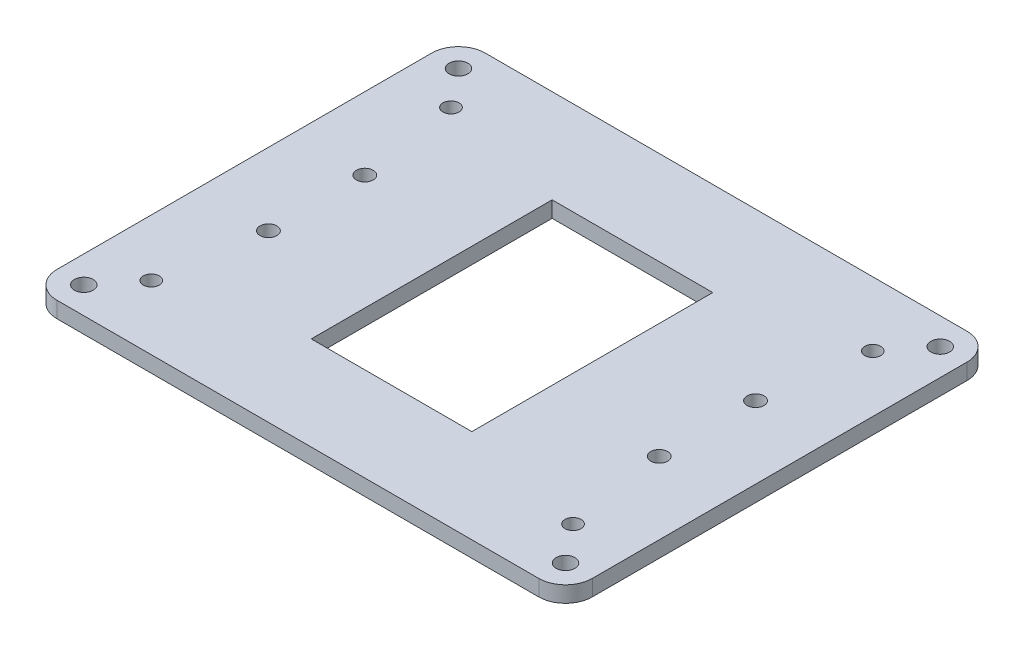
ISO-10303-21;
HEADER;
FILE_DESCRIPTION(('STEP AP214'),'2;1');
FILE_NAME('part.step','',(''),(''),'','','');
FILE_SCHEMA(('AUTOMOTIVE_DESIGN { 1 0 10303 214 1 1 1 1 }'));
ENDSEC;
DATA;
#1=APPLICATION_CONTEXT('core data for automotive mechanical design processes');
#2=APPLICATION_PROTOCOL_DEFINITION('international standard','automotive_design',2000,#1);
#3=PRODUCT_CONTEXT('',#1,'mechanical');
#4=PRODUCT('Part','Part','',(#3));
#5=PRODUCT_RELATED_PRODUCT_CATEGORY('part','',(#4));
#6=PRODUCT_DEFINITION_FORMATION('','',#4);
#7=PRODUCT_DEFINITION_CONTEXT('part definition',#1,'design');
#8=PRODUCT_DEFINITION('design','',#6,#7);
#9=PRODUCT_DEFINITION_SHAPE('','',#8);
#10=(LENGTH_UNIT() NAMED_UNIT(*) SI_UNIT(.MILLI.,.METRE.));
#11=(NAMED_UNIT(*) PLANE_ANGLE_UNIT() SI_UNIT($,.RADIAN.));
#12=(NAMED_UNIT(*) SI_UNIT($,.STERADIAN.) SOLID_ANGLE_UNIT());
#13=UNCERTAINTY_MEASURE_WITH_UNIT(LENGTH_MEASURE(1.E-05),#10,'distance_accuracy_value','');
#14=(GEOMETRIC_REPRESENTATION_CONTEXT(3) GLOBAL_UNCERTAINTY_ASSIGNED_CONTEXT((#13)) GLOBAL_UNIT_ASSIGNED_CONTEXT((#10,
#11,#12)) REPRESENTATION_CONTEXT('',''));
#15=CARTESIAN_POINT('',(0.,0.,0.));
#16=DIRECTION('',(0.,0.,1.));
#17=DIRECTION('',(1.,0.,0.));
#18=AXIS2_PLACEMENT_3D('',#15,#16,#17);
#19=CARTESIAN_POINT('',(45.,3.,-35.));
#20=DIRECTION('',(0.,-1.,0.));
#21=DIRECTION('',(0.,0.,-1.));
#22=AXIS2_PLACEMENT_3D('',#19,#20,#21);
#23=CYLINDRICAL_SURFACE('',#22,5.);
#24=CARTESIAN_POINT('',(45.,0.,-35.));
#25=DIRECTION('',(0.,1.,0.));
#26=DIRECTION('',(0.,0.,-1.));
#27=AXIS2_PLACEMENT_3D('',#24,#25,#26);
#28=CIRCLE('',#27,5.);
#29=CARTESIAN_POINT('',(50.,0.,-35.));
#30=VERTEX_POINT('',#29);
#31=CARTESIAN_POINT('',(45.,0.,-40.));
#32=VERTEX_POINT('',#31);
#33=EDGE_CURVE('E239',#30,#32,#28,.T.);
#34=ORIENTED_EDGE('',*,*,#33,.T.);
#35=DIRECTION('',(0.,-1.,0.));
#36=VECTOR('',#35,1.);
#37=CARTESIAN_POINT('',(45.,3.,-40.));
#38=LINE('',#37,#36);
#39=CARTESIAN_POINT('',(45.,3.,-40.));
#40=VERTEX_POINT('',#39);
#41=EDGE_CURVE('E11',#40,#32,#38,.T.);
#42=ORIENTED_EDGE('',*,*,#41,.F.);
#43=CARTESIAN_POINT('',(45.,3.,-35.));
#44=DIRECTION('',(0.,1.,0.));
#45=DIRECTION('',(0.,0.,-1.));
#46=AXIS2_PLACEMENT_3D('',#43,#44,#45);
#47=CIRCLE('',#46,5.);
#48=CARTESIAN_POINT('',(50.,3.,-35.));
#49=VERTEX_POINT('',#48);
#50=EDGE_CURVE('E220',#49,#40,#47,.T.);
#51=ORIENTED_EDGE('',*,*,#50,.F.);
#52=DIRECTION('',(0.,-1.,0.));
#53=VECTOR('',#52,1.);
#54=CARTESIAN_POINT('',(50.,3.,-35.));
#55=LINE('',#54,#53);
#56=EDGE_CURVE('E238',#49,#30,#55,.T.);
#57=ORIENTED_EDGE('',*,*,#56,.T.);
#58=EDGE_LOOP('',(#34,#42,#51,#57));
#59=FACE_BOUND('',#58,.T.);
#60=ADVANCED_FACE('F33',(#59),#23,.T.);
#61=CARTESIAN_POINT('',(-45.,3.,-40.));
#62=DIRECTION('',(0.,0.,1.));
#63=DIRECTION('',(1.,0.,0.));
#64=AXIS2_PLACEMENT_3D('',#61,#62,#63);
#65=PLANE('',#64);
#66=DIRECTION('',(-1.,0.,0.));
#67=VECTOR('',#66,1.);
#68=CARTESIAN_POINT('',(-45.,0.,-40.));
#69=LINE('',#68,#67);
#70=CARTESIAN_POINT('',(-45.,0.,-40.));
#71=VERTEX_POINT('',#70);
#72=EDGE_CURVE('E242',#32,#71,#69,.T.);
#73=ORIENTED_EDGE('',*,*,#72,.T.);
#74=DIRECTION('',(0.,-1.,0.));
#75=VECTOR('',#74,1.);
#76=CARTESIAN_POINT('',(-45.,3.,-40.));
#77=LINE('',#76,#75);
#78=CARTESIAN_POINT('',(-45.,3.,-40.));
#79=VERTEX_POINT('',#78);
#80=EDGE_CURVE('E41',#79,#71,#77,.T.);
#81=ORIENTED_EDGE('',*,*,#80,.F.);
#82=DIRECTION('',(-1.,0.,0.));
#83=VECTOR('',#82,1.);
#84=CARTESIAN_POINT('',(-45.,3.,-40.));
#85=LINE('',#84,#83);
#86=EDGE_CURVE('E223',#40,#79,#85,.T.);
#87=ORIENTED_EDGE('',*,*,#86,.F.);
#88=ORIENTED_EDGE('',*,*,#41,.T.);
#89=EDGE_LOOP('',(#73,#81,#87,#88));
#90=FACE_BOUND('',#89,.T.);
#91=ADVANCED_FACE('F334',(#90),#65,.F.);
#92=CARTESIAN_POINT('',(-45.,3.,-35.));
#93=DIRECTION('',(0.,-1.,0.));
#94=DIRECTION('',(0.,0.,-1.));
#95=AXIS2_PLACEMENT_3D('',#92,#93,#94);
#96=CYLINDRICAL_SURFACE('',#95,4.99999999999999);
#97=CARTESIAN_POINT('',(-45.,0.,-35.));
#98=DIRECTION('',(0.,1.,0.));
#99=DIRECTION('',(0.,0.,1.));
#100=AXIS2_PLACEMENT_3D('',#97,#98,#99);
#101=CIRCLE('',#100,4.99999999999999);
#102=CARTESIAN_POINT('',(-50.,0.,-35.));
#103=VERTEX_POINT('',#102);
#104=EDGE_CURVE('E244',#71,#103,#101,.T.);
#105=ORIENTED_EDGE('',*,*,#104,.T.);
#106=DIRECTION('',(0.,-1.,0.));
#107=VECTOR('',#106,1.);
#108=CARTESIAN_POINT('',(-50.,3.,-35.));
#109=LINE('',#108,#107);
#110=CARTESIAN_POINT('',(-50.,3.,-35.));
#111=VERTEX_POINT('',#110);
#112=EDGE_CURVE('E269',#111,#103,#109,.T.);
#113=ORIENTED_EDGE('',*,*,#112,.F.);
#114=CARTESIAN_POINT('',(-45.,3.,-35.));
#115=DIRECTION('',(0.,1.,0.));
#116=DIRECTION('',(0.,0.,1.));
#117=AXIS2_PLACEMENT_3D('',#114,#115,#116);
#118=CIRCLE('',#117,4.99999999999999);
#119=EDGE_CURVE('E226',#79,#111,#118,.T.);
#120=ORIENTED_EDGE('',*,*,#119,.F.);
#121=ORIENTED_EDGE('',*,*,#80,.T.);
#122=EDGE_LOOP('',(#105,#113,#120,#121));
#123=FACE_BOUND('',#122,.T.);
#124=ADVANCED_FACE('F330',(#123),#96,.T.);
#125=CARTESIAN_POINT('',(-50.,3.,-35.));
#126=DIRECTION('',(1.,0.,0.));
#127=DIRECTION('',(0.,0.,-1.));
#128=AXIS2_PLACEMENT_3D('',#125,#126,#127);
#129=PLANE('',#128);
#130=DIRECTION('',(0.,0.,1.));
#131=VECTOR('',#130,1.);
#132=CARTESIAN_POINT('',(-50.,0.,-35.));
#133=LINE('',#132,#131);
#134=CARTESIAN_POINT('',(-50.,0.,35.));
#135=VERTEX_POINT('',#134);
#136=EDGE_CURVE('E246',#103,#135,#133,.T.);
#137=ORIENTED_EDGE('',*,*,#136,.T.);
#138=DIRECTION('',(0.,-1.,0.));
#139=VECTOR('',#138,1.);
#140=CARTESIAN_POINT('',(-50.,3.,35.));
#141=LINE('',#140,#139);
#142=CARTESIAN_POINT('',(-50.,3.,35.));
#143=VERTEX_POINT('',#142);
#144=EDGE_CURVE('E266',#143,#135,#141,.T.);
#145=ORIENTED_EDGE('',*,*,#144,.F.);
#146=DIRECTION('',(0.,0.,1.));
#147=VECTOR('',#146,1.);
#148=CARTESIAN_POINT('',(-50.,3.,-35.));
#149=LINE('',#148,#147);
#150=EDGE_CURVE('E228',#111,#143,#149,.T.);
#151=ORIENTED_EDGE('',*,*,#150,.F.);
#152=ORIENTED_EDGE('',*,*,#112,.T.);
#153=EDGE_LOOP('',(#137,#145,#151,#152));
#154=FACE_BOUND('',#153,.T.);
#155=ADVANCED_FACE('F327',(#154),#129,.F.);
#156=CARTESIAN_POINT('',(-45.,3.,35.));
#157=DIRECTION('',(0.,-1.,0.));
#158=DIRECTION('',(0.,0.,-1.));
#159=AXIS2_PLACEMENT_3D('',#156,#157,#158);
#160=CYLINDRICAL_SURFACE('',#159,4.99999999999999);
#161=CARTESIAN_POINT('',(-45.,0.,35.));
#162=DIRECTION('',(0.,1.,0.));
#163=DIRECTION('',(0.,0.,1.));
#164=AXIS2_PLACEMENT_3D('',#161,#162,#163);
#165=CIRCLE('',#164,4.99999999999999);
#166=CARTESIAN_POINT('',(-45.,0.,40.));
#167=VERTEX_POINT('',#166);
#168=EDGE_CURVE('E248',#135,#167,#165,.T.);
#169=ORIENTED_EDGE('',*,*,#168,.T.);
#170=DIRECTION('',(0.,-1.,0.));
#171=VECTOR('',#170,1.);
#172=CARTESIAN_POINT('',(-45.,3.,40.));
#173=LINE('',#172,#171);
#174=CARTESIAN_POINT('',(-45.,3.,40.));
#175=VERTEX_POINT('',#174);
#176=EDGE_CURVE('E263',#175,#167,#173,.T.);
#177=ORIENTED_EDGE('',*,*,#176,.F.);
#178=CARTESIAN_POINT('',(-45.,3.,35.));
#179=DIRECTION('',(0.,1.,0.));
#180=DIRECTION('',(0.,0.,1.));
#181=AXIS2_PLACEMENT_3D('',#178,#179,#180);
#182=CIRCLE('',#181,4.99999999999999);
#183=EDGE_CURVE('E230',#143,#175,#182,.T.);
#184=ORIENTED_EDGE('',*,*,#183,.F.);
#185=ORIENTED_EDGE('',*,*,#144,.T.);
#186=EDGE_LOOP('',(#169,#177,#184,#185));
#187=FACE_BOUND('',#186,.T.);
#188=ADVANCED_FACE('F323',(#187),#160,.T.);
#189=CARTESIAN_POINT('',(-45.,3.,40.));
#190=DIRECTION('',(0.,0.,-1.));
#191=DIRECTION('',(-1.,0.,0.));
#192=AXIS2_PLACEMENT_3D('',#189,#190,#191);
#193=PLANE('',#192);
#194=DIRECTION('',(1.,0.,0.));
#195=VECTOR('',#194,1.);
#196=CARTESIAN_POINT('',(-45.,0.,40.));
#197=LINE('',#196,#195);
#198=CARTESIAN_POINT('',(45.,0.,40.));
#199=VERTEX_POINT('',#198);
#200=EDGE_CURVE('E250',#167,#199,#197,.T.);
#201=ORIENTED_EDGE('',*,*,#200,.T.);
#202=DIRECTION('',(0.,-1.,0.));
#203=VECTOR('',#202,1.);
#204=CARTESIAN_POINT('',(45.,3.,40.));
#205=LINE('',#204,#203);
#206=CARTESIAN_POINT('',(45.,3.,40.));
#207=VERTEX_POINT('',#206);
#208=EDGE_CURVE('E260',#207,#199,#205,.T.);
#209=ORIENTED_EDGE('',*,*,#208,.F.);
#210=DIRECTION('',(1.,0.,0.));
#211=VECTOR('',#210,1.);
#212=CARTESIAN_POINT('',(-45.,3.,40.));
#213=LINE('',#212,#211);
#214=EDGE_CURVE('E232',#175,#207,#213,.T.);
#215=ORIENTED_EDGE('',*,*,#214,.F.);
#216=ORIENTED_EDGE('',*,*,#176,.T.);
#217=EDGE_LOOP('',(#201,#209,#215,#216));
#218=FACE_BOUND('',#217,.T.);
#219=ADVANCED_FACE('F318',(#218),#193,.F.);
#220=CARTESIAN_POINT('',(45.,3.,35.));
#221=DIRECTION('',(0.,-1.,0.));
#222=DIRECTION('',(0.,0.,-1.));
#223=AXIS2_PLACEMENT_3D('',#220,#221,#222);
#224=CYLINDRICAL_SURFACE('',#223,4.99999999999999);
#225=CARTESIAN_POINT('',(45.,0.,35.));
#226=DIRECTION('',(0.,1.,0.));
#227=DIRECTION('',(0.,0.,1.));
#228=AXIS2_PLACEMENT_3D('',#225,#226,#227);
#229=CIRCLE('',#228,4.99999999999999);
#230=CARTESIAN_POINT('',(50.,0.,35.));
#231=VERTEX_POINT('',#230);
#232=EDGE_CURVE('E252',#199,#231,#229,.T.);
#233=ORIENTED_EDGE('',*,*,#232,.T.);
#234=DIRECTION('',(0.,-1.,0.));
#235=VECTOR('',#234,1.);
#236=CARTESIAN_POINT('',(50.,3.,35.));
#237=LINE('',#236,#235);
#238=CARTESIAN_POINT('',(50.,3.,35.));
#239=VERTEX_POINT('',#238);
#240=EDGE_CURVE('E257',#239,#231,#237,.T.);
#241=ORIENTED_EDGE('',*,*,#240,.F.);
#242=CARTESIAN_POINT('',(45.,3.,35.));
#243=DIRECTION('',(0.,1.,0.));
#244=DIRECTION('',(0.,0.,1.));
#245=AXIS2_PLACEMENT_3D('',#242,#243,#244);
#246=CIRCLE('',#245,4.99999999999999);
#247=EDGE_CURVE('E234',#207,#239,#246,.T.);
#248=ORIENTED_EDGE('',*,*,#247,.F.);
#249=ORIENTED_EDGE('',*,*,#208,.T.);
#250=EDGE_LOOP('',(#233,#241,#248,#249));
#251=FACE_BOUND('',#250,.T.);
#252=ADVANCED_FACE('F312',(#251),#224,.T.);
#253=CARTESIAN_POINT('',(50.,3.,-35.));
#254=DIRECTION('',(-1.,0.,0.));
#255=DIRECTION('',(0.,0.,1.));
#256=AXIS2_PLACEMENT_3D('',#253,#254,#255);
#257=PLANE('',#256);
#258=DIRECTION('',(0.,0.,-1.));
#259=VECTOR('',#258,1.);
#260=CARTESIAN_POINT('',(50.,0.,-35.));
#261=LINE('',#260,#259);
#262=EDGE_CURVE('E224',#231,#30,#261,.T.);
#263=ORIENTED_EDGE('',*,*,#262,.T.);
#264=ORIENTED_EDGE('',*,*,#56,.F.);
#265=DIRECTION('',(0.,0.,-1.));
#266=VECTOR('',#265,1.);
#267=CARTESIAN_POINT('',(50.,3.,-35.));
#268=LINE('',#267,#266);
#269=EDGE_CURVE('E236',#239,#49,#268,.T.);
#270=ORIENTED_EDGE('',*,*,#269,.F.);
#271=ORIENTED_EDGE('',*,*,#240,.T.);
#272=EDGE_LOOP('',(#263,#264,#270,#271));
#273=FACE_BOUND('',#272,.T.);
#274=ADVANCED_FACE('F308',(#273),#257,.F.);
#275=CARTESIAN_POINT('',(45.,3.,-35.));
#276=DIRECTION('',(0.,-1.,0.));
#277=DIRECTION('',(0.,0.,-1.));
#278=AXIS2_PLACEMENT_3D('',#275,#276,#277);
#279=PLANE('',#278);
#280=DIRECTION('',(-1.,0.,0.));
#281=VECTOR('',#280,1.);
#282=CARTESIAN_POINT('',(-15.,3.,-22.5));
#283=LINE('',#282,#281);
#284=CARTESIAN_POINT('',(15.,3.,-22.5));
#285=VERTEX_POINT('',#284);
#286=CARTESIAN_POINT('',(-15.,3.,-22.5));
#287=VERTEX_POINT('',#286);
#288=EDGE_CURVE('E150',#285,#287,#283,.T.);
#289=ORIENTED_EDGE('',*,*,#288,.F.);
#290=DIRECTION('',(0.,0.,-1.));
#291=VECTOR('',#290,1.);
#292=CARTESIAN_POINT('',(15.,3.,-22.5));
#293=LINE('',#292,#291);
#294=CARTESIAN_POINT('',(15.,3.,22.5));
#295=VERTEX_POINT('',#294);
#296=EDGE_CURVE('E49',#295,#285,#293,.T.);
#297=ORIENTED_EDGE('',*,*,#296,.F.);
#298=DIRECTION('',(1.,0.,0.));
#299=VECTOR('',#298,1.);
#300=CARTESIAN_POINT('',(-15.,3.,22.5));
#301=LINE('',#300,#299);
#302=CARTESIAN_POINT('',(-15.,3.,22.5));
#303=VERTEX_POINT('',#302);
#304=EDGE_CURVE('E141',#303,#295,#301,.T.);
#305=ORIENTED_EDGE('',*,*,#304,.F.);
#306=DIRECTION('',(0.,0.,1.));
#307=VECTOR('',#306,1.);
#308=CARTESIAN_POINT('',(-15.,3.,-22.5));
#309=LINE('',#308,#307);
#310=EDGE_CURVE('E144',#287,#303,#309,.T.);
#311=ORIENTED_EDGE('',*,*,#310,.F.);
#312=EDGE_LOOP('',(#289,#297,#305,#311));
#313=FACE_BOUND('',#312,.T.);
#314=CARTESIAN_POINT('',(-39.4,3.,28.));
#315=DIRECTION('',(0.,1.,0.));
#316=DIRECTION('',(0.,0.,-1.));
#317=AXIS2_PLACEMENT_3D('',#314,#315,#316);
#318=CIRCLE('',#317,1.5);
#319=CARTESIAN_POINT('',(-39.4,3.,26.5));
#320=VERTEX_POINT('',#319);
#321=EDGE_CURVE('E156',#320,#320,#318,.T.);
#322=ORIENTED_EDGE('',*,*,#321,.F.);
#323=EDGE_LOOP('',(#322));
#324=FACE_BOUND('',#323,.T.);
#325=CARTESIAN_POINT('',(39.4,3.,28.));
#326=DIRECTION('',(0.,1.,0.));
#327=DIRECTION('',(0.,0.,1.));
#328=AXIS2_PLACEMENT_3D('',#325,#326,#327);
#329=CIRCLE('',#328,1.5);
#330=CARTESIAN_POINT('',(39.4,3.,29.5));
#331=VERTEX_POINT('',#330);
#332=EDGE_CURVE('E170',#331,#331,#329,.T.);
#333=ORIENTED_EDGE('',*,*,#332,.F.);
#334=EDGE_LOOP('',(#333));
#335=FACE_BOUND('',#334,.T.);
#336=CARTESIAN_POINT('',(39.4,3.,-28.));
#337=DIRECTION('',(0.,1.,0.));
#338=DIRECTION('',(0.,0.,-1.));
#339=AXIS2_PLACEMENT_3D('',#336,#337,#338);
#340=CIRCLE('',#339,1.5);
#341=CARTESIAN_POINT('',(39.4,3.,-29.5));
#342=VERTEX_POINT('',#341);
#343=EDGE_CURVE('E164',#342,#342,#340,.T.);
#344=ORIENTED_EDGE('',*,*,#343,.F.);
#345=EDGE_LOOP('',(#344));
#346=FACE_BOUND('',#345,.T.);
#347=CARTESIAN_POINT('',(-39.4,3.,-28.));
#348=DIRECTION('',(0.,1.,0.));
#349=DIRECTION('',(0.,0.,1.));
#350=AXIS2_PLACEMENT_3D('',#347,#348,#349);
#351=CIRCLE('',#350,1.5);
#352=CARTESIAN_POINT('',(-39.4,3.,-26.5));
#353=VERTEX_POINT('',#352);
#354=EDGE_CURVE('E163',#353,#353,#351,.T.);
#355=ORIENTED_EDGE('',*,*,#354,.F.);
#356=EDGE_LOOP('',(#355));
#357=FACE_BOUND('',#356,.T.);
#358=CARTESIAN_POINT('',(45.,3.,35.));
#359=DIRECTION('',(0.,1.,0.));
#360=DIRECTION('',(0.,0.,1.));
#361=AXIS2_PLACEMENT_3D('',#358,#359,#360);
#362=CIRCLE('',#361,1.75);
#363=CARTESIAN_POINT('',(45.,3.,36.75));
#364=VERTEX_POINT('',#363);
#365=EDGE_CURVE('E188',#364,#364,#362,.T.);
#366=ORIENTED_EDGE('',*,*,#365,.F.);
#367=EDGE_LOOP('',(#366));
#368=FACE_BOUND('',#367,.T.);
#369=CARTESIAN_POINT('',(-45.,3.,-35.));
#370=DIRECTION('',(0.,1.,0.));
#371=DIRECTION('',(0.,0.,1.));
#372=AXIS2_PLACEMENT_3D('',#369,#370,#371);
#373=CIRCLE('',#372,1.75);
#374=CARTESIAN_POINT('',(-45.,3.,-33.25));
#375=VERTEX_POINT('',#374);
#376=EDGE_CURVE('E194',#375,#375,#373,.T.);
#377=ORIENTED_EDGE('',*,*,#376,.F.);
#378=EDGE_LOOP('',(#377));
#379=FACE_BOUND('',#378,.T.);
#380=CARTESIAN_POINT('',(45.,3.,-35.));
#381=DIRECTION('',(0.,1.,0.));
#382=DIRECTION('',(0.,0.,1.));
#383=AXIS2_PLACEMENT_3D('',#380,#381,#382);
#384=CIRCLE('',#383,1.75);
#385=CARTESIAN_POINT('',(45.,3.,-33.25));
#386=VERTEX_POINT('',#385);
#387=EDGE_CURVE('E181',#386,#386,#384,.T.);
#388=ORIENTED_EDGE('',*,*,#387,.F.);
#389=EDGE_LOOP('',(#388));
#390=FACE_BOUND('',#389,.T.);
#391=CARTESIAN_POINT('',(-45.,3.,35.));
#392=DIRECTION('',(0.,1.,0.));
#393=DIRECTION('',(0.,0.,1.));
#394=AXIS2_PLACEMENT_3D('',#391,#392,#393);
#395=CIRCLE('',#394,1.75);
#396=CARTESIAN_POINT('',(-45.,3.,36.75));
#397=VERTEX_POINT('',#396);
#398=EDGE_CURVE('E187',#397,#397,#395,.T.);
#399=ORIENTED_EDGE('',*,*,#398,.F.);
#400=EDGE_LOOP('',(#399));
#401=FACE_BOUND('',#400,.T.);
#402=CARTESIAN_POINT('',(36.5,3.,-9.00000000000001));
#403=DIRECTION('',(0.,1.,0.));
#404=DIRECTION('',(0.,0.,-1.));
#405=AXIS2_PLACEMENT_3D('',#402,#403,#404);
#406=CIRCLE('',#405,1.57499999999999);
#407=CARTESIAN_POINT('',(36.5,3.,-10.575));
#408=VERTEX_POINT('',#407);
#409=EDGE_CURVE('E205',#408,#408,#406,.T.);
#410=ORIENTED_EDGE('',*,*,#409,.F.);
#411=EDGE_LOOP('',(#410));
#412=FACE_BOUND('',#411,.T.);
#413=CARTESIAN_POINT('',(36.5,3.,9.00000000000001));
#414=DIRECTION('',(0.,1.,0.));
#415=DIRECTION('',(0.,0.,1.));
#416=AXIS2_PLACEMENT_3D('',#413,#414,#415);
#417=CIRCLE('',#416,1.57499999999999);
#418=CARTESIAN_POINT('',(36.5,3.,10.575));
#419=VERTEX_POINT('',#418);
#420=EDGE_CURVE('E212',#419,#419,#417,.T.);
#421=ORIENTED_EDGE('',*,*,#420,.F.);
#422=EDGE_LOOP('',(#421));
#423=FACE_BOUND('',#422,.T.);
#424=CARTESIAN_POINT('',(-36.5,3.,9.));
#425=DIRECTION('',(0.,1.,0.));
#426=DIRECTION('',(0.,0.,-1.));
#427=AXIS2_PLACEMENT_3D('',#424,#425,#426);
#428=CIRCLE('',#427,1.57499999999999);
#429=CARTESIAN_POINT('',(-36.5,3.,7.42500000000001));
#430=VERTEX_POINT('',#429);
#431=EDGE_CURVE('E208',#430,#430,#428,.T.);
#432=ORIENTED_EDGE('',*,*,#431,.F.);
#433=EDGE_LOOP('',(#432));
#434=FACE_BOUND('',#433,.T.);
#435=CARTESIAN_POINT('',(-36.5,3.,-9.));
#436=DIRECTION('',(0.,1.,0.));
#437=DIRECTION('',(0.,0.,1.));
#438=AXIS2_PLACEMENT_3D('',#435,#436,#437);
#439=CIRCLE('',#438,1.57499999999999);
#440=CARTESIAN_POINT('',(-36.5,3.,-7.42500000000001));
#441=VERTEX_POINT('',#440);
#442=EDGE_CURVE('E211',#441,#441,#439,.T.);
#443=ORIENTED_EDGE('',*,*,#442,.F.);
#444=EDGE_LOOP('',(#443));
#445=FACE_BOUND('',#444,.T.);
#446=ORIENTED_EDGE('',*,*,#50,.T.);
#447=ORIENTED_EDGE('',*,*,#86,.T.);
#448=ORIENTED_EDGE('',*,*,#119,.T.);
#449=ORIENTED_EDGE('',*,*,#150,.T.);
#450=ORIENTED_EDGE('',*,*,#183,.T.);
#451=ORIENTED_EDGE('',*,*,#214,.T.);
#452=ORIENTED_EDGE('',*,*,#247,.T.);
#453=ORIENTED_EDGE('',*,*,#269,.T.);
#454=EDGE_LOOP('',(#446,#447,#448,#449,#450,#451,#452,#453));
#455=FACE_BOUND('',#454,.T.);
#456=ADVANCED_FACE('F291',(#313,#324,#335,#346,#357,#368,#379,#390,#401,#412,#423,#434,#445,
#455),#279,.F.);
#457=CARTESIAN_POINT('',(45.,0.,-35.));
#458=DIRECTION('',(0.,-1.,0.));
#459=DIRECTION('',(0.,0.,-1.));
#460=AXIS2_PLACEMENT_3D('',#457,#458,#459);
#461=PLANE('',#460);
#462=DIRECTION('',(0.,0.,-1.));
#463=VECTOR('',#462,1.);
#464=CARTESIAN_POINT('',(15.,0.,-22.5));
#465=LINE('',#464,#463);
#466=CARTESIAN_POINT('',(15.,0.,22.5));
#467=VERTEX_POINT('',#466);
#468=CARTESIAN_POINT('',(15.,0.,-22.5));
#469=VERTEX_POINT('',#468);
#470=EDGE_CURVE('E125',#467,#469,#465,.T.);
#471=ORIENTED_EDGE('',*,*,#470,.T.);
#472=DIRECTION('',(-1.,0.,0.));
#473=VECTOR('',#472,1.);
#474=CARTESIAN_POINT('',(-15.,0.,-22.5));
#475=LINE('',#474,#473);
#476=CARTESIAN_POINT('',(-15.,0.,-22.5));
#477=VERTEX_POINT('',#476);
#478=EDGE_CURVE('E134',#469,#477,#475,.T.);
#479=ORIENTED_EDGE('',*,*,#478,.T.);
#480=DIRECTION('',(0.,0.,1.));
#481=VECTOR('',#480,1.);
#482=CARTESIAN_POINT('',(-15.,0.,-22.5));
#483=LINE('',#482,#481);
#484=CARTESIAN_POINT('',(-15.,0.,22.5));
#485=VERTEX_POINT('',#484);
#486=EDGE_CURVE('E57',#477,#485,#483,.T.);
#487=ORIENTED_EDGE('',*,*,#486,.T.);
#488=DIRECTION('',(1.,0.,0.));
#489=VECTOR('',#488,1.);
#490=CARTESIAN_POINT('',(-15.,0.,22.5));
#491=LINE('',#490,#489);
#492=EDGE_CURVE('E131',#485,#467,#491,.T.);
#493=ORIENTED_EDGE('',*,*,#492,.T.);
#494=EDGE_LOOP('',(#471,#479,#487,#493));
#495=FACE_BOUND('',#494,.T.);
#496=CARTESIAN_POINT('',(-39.4,0.,28.));
#497=DIRECTION('',(0.,1.,0.));
#498=DIRECTION('',(0.,0.,-1.));
#499=AXIS2_PLACEMENT_3D('',#496,#497,#498);
#500=CIRCLE('',#499,1.5);
#501=CARTESIAN_POINT('',(-39.4,0.,26.5));
#502=VERTEX_POINT('',#501);
#503=EDGE_CURVE('E173',#502,#502,#500,.T.);
#504=ORIENTED_EDGE('',*,*,#503,.T.);
#505=EDGE_LOOP('',(#504));
#506=FACE_BOUND('',#505,.T.);
#507=CARTESIAN_POINT('',(39.4,0.,28.));
#508=DIRECTION('',(0.,1.,0.));
#509=DIRECTION('',(0.,0.,1.));
#510=AXIS2_PLACEMENT_3D('',#507,#508,#509);
#511=CIRCLE('',#510,1.5);
#512=CARTESIAN_POINT('',(39.4,0.,29.5));
#513=VERTEX_POINT('',#512);
#514=EDGE_CURVE('E167',#513,#513,#511,.T.);
#515=ORIENTED_EDGE('',*,*,#514,.T.);
#516=EDGE_LOOP('',(#515));
#517=FACE_BOUND('',#516,.T.);
#518=CARTESIAN_POINT('',(39.4,0.,-28.));
#519=DIRECTION('',(0.,1.,0.));
#520=DIRECTION('',(0.,0.,-1.));
#521=AXIS2_PLACEMENT_3D('',#518,#519,#520);
#522=CIRCLE('',#521,1.5);
#523=CARTESIAN_POINT('',(39.4,0.,-29.5));
#524=VERTEX_POINT('',#523);
#525=EDGE_CURVE('E160',#524,#524,#522,.T.);
#526=ORIENTED_EDGE('',*,*,#525,.T.);
#527=EDGE_LOOP('',(#526));
#528=FACE_BOUND('',#527,.T.);
#529=CARTESIAN_POINT('',(-39.4,0.,-28.));
#530=DIRECTION('',(0.,1.,0.));
#531=DIRECTION('',(0.,0.,1.));
#532=AXIS2_PLACEMENT_3D('',#529,#530,#531);
#533=CIRCLE('',#532,1.5);
#534=CARTESIAN_POINT('',(-39.4,0.,-26.5));
#535=VERTEX_POINT('',#534);
#536=EDGE_CURVE('E178',#535,#535,#533,.T.);
#537=ORIENTED_EDGE('',*,*,#536,.T.);
#538=EDGE_LOOP('',(#537));
#539=FACE_BOUND('',#538,.T.);
#540=CARTESIAN_POINT('',(45.,0.,35.));
#541=DIRECTION('',(0.,1.,0.));
#542=DIRECTION('',(0.,0.,1.));
#543=AXIS2_PLACEMENT_3D('',#540,#541,#542);
#544=CIRCLE('',#543,1.75);
#545=CARTESIAN_POINT('',(45.,0.,36.75));
#546=VERTEX_POINT('',#545);
#547=EDGE_CURVE('E184',#546,#546,#544,.T.);
#548=ORIENTED_EDGE('',*,*,#547,.T.);
#549=EDGE_LOOP('',(#548));
#550=FACE_BOUND('',#549,.T.);
#551=CARTESIAN_POINT('',(-45.,0.,-35.));
#552=DIRECTION('',(0.,1.,0.));
#553=DIRECTION('',(0.,0.,1.));
#554=AXIS2_PLACEMENT_3D('',#551,#552,#553);
#555=CIRCLE('',#554,1.75);
#556=CARTESIAN_POINT('',(-45.,0.,-33.25));
#557=VERTEX_POINT('',#556);
#558=EDGE_CURVE('E191',#557,#557,#555,.T.);
#559=ORIENTED_EDGE('',*,*,#558,.T.);
#560=EDGE_LOOP('',(#559));
#561=FACE_BOUND('',#560,.T.);
#562=CARTESIAN_POINT('',(45.,0.,-35.));
#563=DIRECTION('',(0.,1.,0.));
#564=DIRECTION('',(0.,0.,1.));
#565=AXIS2_PLACEMENT_3D('',#562,#563,#564);
#566=CIRCLE('',#565,1.75);
#567=CARTESIAN_POINT('',(45.,0.,-33.25));
#568=VERTEX_POINT('',#567);
#569=EDGE_CURVE('E197',#568,#568,#566,.T.);
#570=ORIENTED_EDGE('',*,*,#569,.T.);
#571=EDGE_LOOP('',(#570));
#572=FACE_BOUND('',#571,.T.);
#573=CARTESIAN_POINT('',(-45.,0.,35.));
#574=DIRECTION('',(0.,1.,0.));
#575=DIRECTION('',(0.,0.,1.));
#576=AXIS2_PLACEMENT_3D('',#573,#574,#575);
#577=CIRCLE('',#576,1.75);
#578=CARTESIAN_POINT('',(-45.,0.,36.75));
#579=VERTEX_POINT('',#578);
#580=EDGE_CURVE('E202',#579,#579,#577,.T.);
#581=ORIENTED_EDGE('',*,*,#580,.T.);
#582=EDGE_LOOP('',(#581));
#583=FACE_BOUND('',#582,.T.);
#584=CARTESIAN_POINT('',(36.5,0.,-9.00000000000001));
#585=DIRECTION('',(0.,-1.,0.));
#586=DIRECTION('',(0.,0.,-1.));
#587=AXIS2_PLACEMENT_3D('',#584,#585,#586);
#588=CIRCLE('',#587,1.57499999999999);
#589=CARTESIAN_POINT('',(36.5,0.,-10.575));
#590=VERTEX_POINT('',#589);
#591=EDGE_CURVE('E36',#590,#590,#588,.T.);
#592=ORIENTED_EDGE('',*,*,#591,.F.);
#593=EDGE_LOOP('',(#592));
#594=FACE_BOUND('',#593,.T.);
#595=CARTESIAN_POINT('',(36.5,0.,9.00000000000001));
#596=DIRECTION('',(0.,-1.,0.));
#597=DIRECTION('',(0.,0.,-1.));
#598=AXIS2_PLACEMENT_3D('',#595,#596,#597);
#599=CIRCLE('',#598,1.57499999999999);
#600=CARTESIAN_POINT('',(36.5,0.,7.42500000000002));
#601=VERTEX_POINT('',#600);
#602=EDGE_CURVE('E278',#601,#601,#599,.T.);
#603=ORIENTED_EDGE('',*,*,#602,.F.);
#604=EDGE_LOOP('',(#603));
#605=FACE_BOUND('',#604,.T.);
#606=CARTESIAN_POINT('',(-36.5,0.,9.));
#607=DIRECTION('',(0.,-1.,0.));
#608=DIRECTION('',(0.,0.,-1.));
#609=AXIS2_PLACEMENT_3D('',#606,#607,#608);
#610=CIRCLE('',#609,1.57499999999999);
#611=CARTESIAN_POINT('',(-36.5,0.,7.42500000000001));
#612=VERTEX_POINT('',#611);
#613=EDGE_CURVE('E276',#612,#612,#610,.T.);
#614=ORIENTED_EDGE('',*,*,#613,.F.);
#615=EDGE_LOOP('',(#614));
#616=FACE_BOUND('',#615,.T.);
#617=CARTESIAN_POINT('',(-36.5,0.,-9.));
#618=DIRECTION('',(0.,-1.,0.));
#619=DIRECTION('',(0.,0.,-1.));
#620=AXIS2_PLACEMENT_3D('',#617,#618,#619);
#621=CIRCLE('',#620,1.57499999999999);
#622=CARTESIAN_POINT('',(-36.5,0.,-10.575));
#623=VERTEX_POINT('',#622);
#624=EDGE_CURVE('E219',#623,#623,#621,.T.);
#625=ORIENTED_EDGE('',*,*,#624,.F.);
#626=EDGE_LOOP('',(#625));
#627=FACE_BOUND('',#626,.T.);
#628=ORIENTED_EDGE('',*,*,#33,.F.);
#629=ORIENTED_EDGE('',*,*,#262,.F.);
#630=ORIENTED_EDGE('',*,*,#232,.F.);
#631=ORIENTED_EDGE('',*,*,#200,.F.);
#632=ORIENTED_EDGE('',*,*,#168,.F.);
#633=ORIENTED_EDGE('',*,*,#136,.F.);
#634=ORIENTED_EDGE('',*,*,#104,.F.);
#635=ORIENTED_EDGE('',*,*,#72,.F.);
#636=EDGE_LOOP('',(#628,#629,#630,#631,#632,#633,#634,#635));
#637=FACE_BOUND('',#636,.T.);
#638=ADVANCED_FACE('F138',(#495,#506,#517,#528,#539,#550,#561,#572,#583,#594,#605,#616,#627,
#637),#461,.T.);
#639=CARTESIAN_POINT('',(-36.5,-1.,-9.));
#640=DIRECTION('',(0.,1.,0.));
#641=DIRECTION('',(0.,0.,1.));
#642=AXIS2_PLACEMENT_3D('',#639,#640,#641);
#643=CYLINDRICAL_SURFACE('',#642,1.57499999999999);
#644=ORIENTED_EDGE('',*,*,#624,.T.);
#645=EDGE_LOOP('',(#644));
#646=FACE_BOUND('',#645,.T.);
#647=ORIENTED_EDGE('',*,*,#442,.T.);
#648=EDGE_LOOP('',(#647));
#649=FACE_BOUND('',#648,.T.);
#650=ADVANCED_FACE('F290',(#646,#649),#643,.F.);
#651=CARTESIAN_POINT('',(-36.5,-1.,9.));
#652=DIRECTION('',(0.,1.,0.));
#653=DIRECTION('',(0.,0.,1.));
#654=AXIS2_PLACEMENT_3D('',#651,#652,#653);
#655=CYLINDRICAL_SURFACE('',#654,1.57499999999999);
#656=ORIENTED_EDGE('',*,*,#613,.T.);
#657=EDGE_LOOP('',(#656));
#658=FACE_BOUND('',#657,.T.);
#659=ORIENTED_EDGE('',*,*,#431,.T.);
#660=EDGE_LOOP('',(#659));
#661=FACE_BOUND('',#660,.T.);
#662=ADVANCED_FACE('F388',(#658,#661),#655,.F.);
#663=CARTESIAN_POINT('',(36.5,-1.,9.00000000000001));
#664=DIRECTION('',(0.,1.,0.));
#665=DIRECTION('',(0.,0.,1.));
#666=AXIS2_PLACEMENT_3D('',#663,#664,#665);
#667=CYLINDRICAL_SURFACE('',#666,1.57499999999999);
#668=ORIENTED_EDGE('',*,*,#602,.T.);
#669=EDGE_LOOP('',(#668));
#670=FACE_BOUND('',#669,.T.);
#671=ORIENTED_EDGE('',*,*,#420,.T.);
#672=EDGE_LOOP('',(#671));
#673=FACE_BOUND('',#672,.T.);
#674=ADVANCED_FACE('F394',(#670,#673),#667,.F.);
#675=CARTESIAN_POINT('',(36.5,-1.,-9.00000000000001));
#676=DIRECTION('',(0.,1.,0.));
#677=DIRECTION('',(0.,0.,1.));
#678=AXIS2_PLACEMENT_3D('',#675,#676,#677);
#679=CYLINDRICAL_SURFACE('',#678,1.57499999999999);
#680=ORIENTED_EDGE('',*,*,#591,.T.);
#681=EDGE_LOOP('',(#680));
#682=FACE_BOUND('',#681,.T.);
#683=ORIENTED_EDGE('',*,*,#409,.T.);
#684=EDGE_LOOP('',(#683));
#685=FACE_BOUND('',#684,.T.);
#686=ADVANCED_FACE('F285',(#682,#685),#679,.F.);
#687=CARTESIAN_POINT('',(-45.,0.,35.));
#688=DIRECTION('',(0.,1.,0.));
#689=DIRECTION('',(0.,0.,1.));
#690=AXIS2_PLACEMENT_3D('',#687,#688,#689);
#691=CYLINDRICAL_SURFACE('',#690,1.75);
#692=ORIENTED_EDGE('',*,*,#580,.F.);
#693=EDGE_LOOP('',(#692));
#694=FACE_BOUND('',#693,.T.);
#695=ORIENTED_EDGE('',*,*,#398,.T.);
#696=EDGE_LOOP('',(#695));
#697=FACE_BOUND('',#696,.T.);
#698=ADVANCED_FACE('F408',(#694,#697),#691,.F.);
#699=CARTESIAN_POINT('',(45.,0.,-35.));
#700=DIRECTION('',(0.,1.,0.));
#701=DIRECTION('',(0.,0.,1.));
#702=AXIS2_PLACEMENT_3D('',#699,#700,#701);
#703=CYLINDRICAL_SURFACE('',#702,1.75);
#704=ORIENTED_EDGE('',*,*,#569,.F.);
#705=EDGE_LOOP('',(#704));
#706=FACE_BOUND('',#705,.T.);
#707=ORIENTED_EDGE('',*,*,#387,.T.);
#708=EDGE_LOOP('',(#707));
#709=FACE_BOUND('',#708,.T.);
#710=ADVANCED_FACE('F415',(#706,#709),#703,.F.);
#711=CARTESIAN_POINT('',(-45.,0.,-35.));
#712=DIRECTION('',(0.,1.,0.));
#713=DIRECTION('',(0.,0.,1.));
#714=AXIS2_PLACEMENT_3D('',#711,#712,#713);
#715=CYLINDRICAL_SURFACE('',#714,1.75);
#716=ORIENTED_EDGE('',*,*,#558,.F.);
#717=EDGE_LOOP('',(#716));
#718=FACE_BOUND('',#717,.T.);
#719=ORIENTED_EDGE('',*,*,#376,.T.);
#720=EDGE_LOOP('',(#719));
#721=FACE_BOUND('',#720,.T.);
#722=ADVANCED_FACE('F423',(#718,#721),#715,.F.);
#723=CARTESIAN_POINT('',(45.,0.,35.));
#724=DIRECTION('',(0.,1.,0.));
#725=DIRECTION('',(0.,0.,1.));
#726=AXIS2_PLACEMENT_3D('',#723,#724,#725);
#727=CYLINDRICAL_SURFACE('',#726,1.75);
#728=ORIENTED_EDGE('',*,*,#547,.F.);
#729=EDGE_LOOP('',(#728));
#730=FACE_BOUND('',#729,.T.);
#731=ORIENTED_EDGE('',*,*,#365,.T.);
#732=EDGE_LOOP('',(#731));
#733=FACE_BOUND('',#732,.T.);
#734=ADVANCED_FACE('F431',(#730,#733),#727,.F.);
#735=CARTESIAN_POINT('',(-39.4,0.,-28.));
#736=DIRECTION('',(0.,1.,0.));
#737=DIRECTION('',(0.,0.,1.));
#738=AXIS2_PLACEMENT_3D('',#735,#736,#737);
#739=CYLINDRICAL_SURFACE('',#738,1.5);
#740=ORIENTED_EDGE('',*,*,#536,.F.);
#741=EDGE_LOOP('',(#740));
#742=FACE_BOUND('',#741,.T.);
#743=ORIENTED_EDGE('',*,*,#354,.T.);
#744=EDGE_LOOP('',(#743));
#745=FACE_BOUND('',#744,.T.);
#746=ADVANCED_FACE('F439',(#742,#745),#739,.F.);
#747=CARTESIAN_POINT('',(39.4,0.,-28.));
#748=DIRECTION('',(0.,1.,0.));
#749=DIRECTION('',(0.,0.,1.));
#750=AXIS2_PLACEMENT_3D('',#747,#748,#749);
#751=CYLINDRICAL_SURFACE('',#750,1.5);
#752=ORIENTED_EDGE('',*,*,#525,.F.);
#753=EDGE_LOOP('',(#752));
#754=FACE_BOUND('',#753,.T.);
#755=ORIENTED_EDGE('',*,*,#343,.T.);
#756=EDGE_LOOP('',(#755));
#757=FACE_BOUND('',#756,.T.);
#758=ADVANCED_FACE('F447',(#754,#757),#751,.F.);
#759=CARTESIAN_POINT('',(39.4,0.,28.));
#760=DIRECTION('',(0.,1.,0.));
#761=DIRECTION('',(0.,0.,1.));
#762=AXIS2_PLACEMENT_3D('',#759,#760,#761);
#763=CYLINDRICAL_SURFACE('',#762,1.5);
#764=ORIENTED_EDGE('',*,*,#514,.F.);
#765=EDGE_LOOP('',(#764));
#766=FACE_BOUND('',#765,.T.);
#767=ORIENTED_EDGE('',*,*,#332,.T.);
#768=EDGE_LOOP('',(#767));
#769=FACE_BOUND('',#768,.T.);
#770=ADVANCED_FACE('F455',(#766,#769),#763,.F.);
#771=CARTESIAN_POINT('',(-39.4,0.,28.));
#772=DIRECTION('',(0.,1.,0.));
#773=DIRECTION('',(0.,0.,1.));
#774=AXIS2_PLACEMENT_3D('',#771,#772,#773);
#775=CYLINDRICAL_SURFACE('',#774,1.5);
#776=ORIENTED_EDGE('',*,*,#503,.F.);
#777=EDGE_LOOP('',(#776));
#778=FACE_BOUND('',#777,.T.);
#779=ORIENTED_EDGE('',*,*,#321,.T.);
#780=EDGE_LOOP('',(#779));
#781=FACE_BOUND('',#780,.T.);
#782=ADVANCED_FACE('F463',(#778,#781),#775,.F.);
#783=CARTESIAN_POINT('',(15.,0.,-22.5));
#784=DIRECTION('',(1.,0.,0.));
#785=DIRECTION('',(0.,0.,-1.));
#786=AXIS2_PLACEMENT_3D('',#783,#784,#785);
#787=PLANE('',#786);
#788=ORIENTED_EDGE('',*,*,#296,.T.);
#789=DIRECTION('',(0.,1.,0.));
#790=VECTOR('',#789,1.);
#791=CARTESIAN_POINT('',(15.,0.,-22.5));
#792=LINE('',#791,#790);
#793=EDGE_CURVE('E121',#469,#285,#792,.T.);
#794=ORIENTED_EDGE('',*,*,#793,.F.);
#795=ORIENTED_EDGE('',*,*,#470,.F.);
#796=DIRECTION('',(0.,1.,0.));
#797=VECTOR('',#796,1.);
#798=CARTESIAN_POINT('',(15.,0.,22.5));
#799=LINE('',#798,#797);
#800=EDGE_CURVE('E154',#467,#295,#799,.T.);
#801=ORIENTED_EDGE('',*,*,#800,.T.);
#802=EDGE_LOOP('',(#788,#794,#795,#801));
#803=FACE_BOUND('',#802,.T.);
#804=ADVANCED_FACE('F123',(#803),#787,.F.);
#805=CARTESIAN_POINT('',(-15.,0.,22.5));
#806=DIRECTION('',(0.,0.,1.));
#807=DIRECTION('',(1.,0.,0.));
#808=AXIS2_PLACEMENT_3D('',#805,#806,#807);
#809=PLANE('',#808);
#810=ORIENTED_EDGE('',*,*,#304,.T.);
#811=ORIENTED_EDGE('',*,*,#800,.F.);
#812=ORIENTED_EDGE('',*,*,#492,.F.);
#813=DIRECTION('',(0.,1.,0.));
#814=VECTOR('',#813,1.);
#815=CARTESIAN_POINT('',(-15.,0.,22.5));
#816=LINE('',#815,#814);
#817=EDGE_CURVE('E157',#485,#303,#816,.T.);
#818=ORIENTED_EDGE('',*,*,#817,.T.);
#819=EDGE_LOOP('',(#810,#811,#812,#818));
#820=FACE_BOUND('',#819,.T.);
#821=ADVANCED_FACE('F476',(#820),#809,.F.);
#822=CARTESIAN_POINT('',(-15.,0.,-22.5));
#823=DIRECTION('',(-1.,0.,0.));
#824=DIRECTION('',(0.,0.,1.));
#825=AXIS2_PLACEMENT_3D('',#822,#823,#824);
#826=PLANE('',#825);
#827=ORIENTED_EDGE('',*,*,#310,.T.);
#828=ORIENTED_EDGE('',*,*,#817,.F.);
#829=ORIENTED_EDGE('',*,*,#486,.F.);
#830=DIRECTION('',(0.,1.,0.));
#831=VECTOR('',#830,1.);
#832=CARTESIAN_POINT('',(-15.,0.,-22.5));
#833=LINE('',#832,#831);
#834=EDGE_CURVE('E130',#477,#287,#833,.T.);
#835=ORIENTED_EDGE('',*,*,#834,.T.);
#836=EDGE_LOOP('',(#827,#828,#829,#835));
#837=FACE_BOUND('',#836,.T.);
#838=ADVANCED_FACE('F483',(#837),#826,.F.);
#839=CARTESIAN_POINT('',(-15.,0.,-22.5));
#840=DIRECTION('',(0.,0.,-1.));
#841=DIRECTION('',(-1.,0.,0.));
#842=AXIS2_PLACEMENT_3D('',#839,#840,#841);
#843=PLANE('',#842);
#844=ORIENTED_EDGE('',*,*,#288,.T.);
#845=ORIENTED_EDGE('',*,*,#834,.F.);
#846=ORIENTED_EDGE('',*,*,#478,.F.);
#847=ORIENTED_EDGE('',*,*,#793,.T.);
#848=EDGE_LOOP('',(#844,#845,#846,#847));
#849=FACE_BOUND('',#848,.T.);
#850=ADVANCED_FACE('F135',(#849),#843,.F.);
#851=CLOSED_SHELL('',(#60,#91,#124,#155,#188,#219,#252,#274,#456,#638,#650,#662,#674,#686,#698,
#710,#722,#734,#746,#758,#770,#782,#804,#821,#838,#850));
#852=MANIFOLD_SOLID_BREP('B2',#851);
#853=ADVANCED_BREP_SHAPE_REPRESENTATION('',(#18,#852),#14);
#854=SHAPE_DEFINITION_REPRESENTATION(#9,#853);
ENDSEC;
END-ISO-10303-21;
